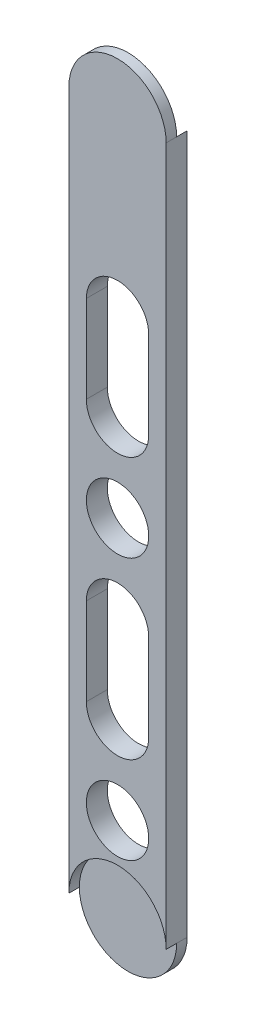
ISO-10303-21;
HEADER;
FILE_DESCRIPTION(('STEP AP214'),'2;1');
FILE_NAME('part.step','',(''),(''),'','','');
FILE_SCHEMA(('AUTOMOTIVE_DESIGN { 1 0 10303 214 1 1 1 1 }'));
ENDSEC;
DATA;
#1=APPLICATION_CONTEXT('core data for automotive mechanical design processes');
#2=APPLICATION_PROTOCOL_DEFINITION('international standard','automotive_design',2000,#1);
#3=PRODUCT_CONTEXT('',#1,'mechanical');
#4=PRODUCT('Part','Part','',(#3));
#5=PRODUCT_RELATED_PRODUCT_CATEGORY('part','',(#4));
#6=PRODUCT_DEFINITION_FORMATION('','',#4);
#7=PRODUCT_DEFINITION_CONTEXT('part definition',#1,'design');
#8=PRODUCT_DEFINITION('design','',#6,#7);
#9=PRODUCT_DEFINITION_SHAPE('','',#8);
#10=(LENGTH_UNIT() NAMED_UNIT(*) SI_UNIT(.MILLI.,.METRE.));
#11=(NAMED_UNIT(*) PLANE_ANGLE_UNIT() SI_UNIT($,.RADIAN.));
#12=(NAMED_UNIT(*) SI_UNIT($,.STERADIAN.) SOLID_ANGLE_UNIT());
#13=UNCERTAINTY_MEASURE_WITH_UNIT(LENGTH_MEASURE(1.E-05),#10,'distance_accuracy_value','');
#14=(GEOMETRIC_REPRESENTATION_CONTEXT(3) GLOBAL_UNCERTAINTY_ASSIGNED_CONTEXT((#13)) GLOBAL_UNIT_ASSIGNED_CONTEXT((#10,
#11,#12)) REPRESENTATION_CONTEXT('',''));
#15=CARTESIAN_POINT('',(0.,0.,0.));
#16=DIRECTION('',(0.,0.,1.));
#17=DIRECTION('',(1.,0.,0.));
#18=AXIS2_PLACEMENT_3D('',#15,#16,#17);
#19=CARTESIAN_POINT('',(0.,0.,6.));
#20=DIRECTION('',(0.,0.,1.));
#21=DIRECTION('',(1.,0.,0.));
#22=AXIS2_PLACEMENT_3D('',#19,#20,#21);
#23=PLANE('',#22);
#24=CARTESIAN_POINT('',(41.0421052631579,15.9190789473683,6.));
#25=DIRECTION('',(0.,0.,1.));
#26=DIRECTION('',(1.,0.,0.));
#27=AXIS2_PLACEMENT_3D('',#24,#25,#26);
#28=CIRCLE('',#27,8.925);
#29=CARTESIAN_POINT('',(49.9671052631579,15.9190789473683,6.));
#30=VERTEX_POINT('',#29);
#31=EDGE_CURVE('E260',#30,#30,#28,.T.);
#32=ORIENTED_EDGE('',*,*,#31,.F.);
#33=EDGE_LOOP('',(#32));
#34=FACE_BOUND('',#33,.T.);
#35=CARTESIAN_POINT('',(41.0421052631579,90.9190789473683,6.));
#36=DIRECTION('',(0.,0.,1.));
#37=DIRECTION('',(1.,0.,0.));
#38=AXIS2_PLACEMENT_3D('',#35,#36,#37);
#39=CIRCLE('',#38,8.925);
#40=CARTESIAN_POINT('',(49.9671052631579,90.9190789473683,6.));
#41=VERTEX_POINT('',#40);
#42=EDGE_CURVE('E160',#41,#41,#39,.T.);
#43=ORIENTED_EDGE('',*,*,#42,.F.);
#44=EDGE_LOOP('',(#43));
#45=FACE_BOUND('',#44,.T.);
#46=CARTESIAN_POINT('',(41.0421052631579,-9.08092105263172,6.));
#47=DIRECTION('',(0.,0.,1.));
#48=DIRECTION('',(1.,0.,0.));
#49=AXIS2_PLACEMENT_3D('',#46,#47,#48);
#50=CIRCLE('',#49,13.925);
#51=CARTESIAN_POINT('',(54.9671052631579,-9.08092105263172,6.));
#52=VERTEX_POINT('',#51);
#53=CARTESIAN_POINT('',(27.1171052631579,-9.08092105263173,6.));
#54=VERTEX_POINT('',#53);
#55=EDGE_CURVE('E196',#52,#54,#50,.T.);
#56=ORIENTED_EDGE('',*,*,#55,.F.);
#57=DIRECTION('',(0.,-1.,0.));
#58=VECTOR('',#57,1.);
#59=CARTESIAN_POINT('',(54.9671052631579,0.,6.));
#60=LINE('',#59,#58);
#61=CARTESIAN_POINT('',(54.9671052631579,190.919078947368,6.));
#62=VERTEX_POINT('',#61);
#63=EDGE_CURVE('E203',#62,#52,#60,.T.);
#64=ORIENTED_EDGE('',*,*,#63,.F.);
#65=CARTESIAN_POINT('',(41.0421052631579,190.919078947368,6.));
#66=DIRECTION('',(0.,0.,1.));
#67=DIRECTION('',(1.,0.,0.));
#68=AXIS2_PLACEMENT_3D('',#65,#66,#67);
#69=CIRCLE('',#68,13.925);
#70=CARTESIAN_POINT('',(27.1171052631579,190.919078947368,6.));
#71=VERTEX_POINT('',#70);
#72=EDGE_CURVE('E206',#71,#62,#69,.F.);
#73=ORIENTED_EDGE('',*,*,#72,.F.);
#74=DIRECTION('',(0.,-1.,0.));
#75=VECTOR('',#74,1.);
#76=CARTESIAN_POINT('',(27.1171052631579,0.,6.));
#77=LINE('',#76,#75);
#78=EDGE_CURVE('E210',#71,#54,#77,.T.);
#79=ORIENTED_EDGE('',*,*,#78,.T.);
#80=EDGE_LOOP('',(#56,#64,#73,#79));
#81=FACE_BOUND('',#80,.T.);
#82=DIRECTION('',(0.,-1.,0.));
#83=VECTOR('',#82,1.);
#84=CARTESIAN_POINT('',(32.1171052631578,0.,6.));
#85=LINE('',#84,#83);
#86=CARTESIAN_POINT('',(32.1171052631579,140.919078947368,6.));
#87=VERTEX_POINT('',#86);
#88=CARTESIAN_POINT('',(32.1171052631578,115.919078947368,6.));
#89=VERTEX_POINT('',#88);
#90=EDGE_CURVE('E169',#87,#89,#85,.T.);
#91=ORIENTED_EDGE('',*,*,#90,.F.);
#92=CARTESIAN_POINT('',(41.0421052631579,140.919078947368,6.));
#93=DIRECTION('',(0.,0.,1.));
#94=DIRECTION('',(1.,0.,0.));
#95=AXIS2_PLACEMENT_3D('',#92,#93,#94);
#96=CIRCLE('',#95,8.925);
#97=CARTESIAN_POINT('',(49.9671052631579,140.919078947368,6.));
#98=VERTEX_POINT('',#97);
#99=EDGE_CURVE('E166',#87,#98,#96,.F.);
#100=ORIENTED_EDGE('',*,*,#99,.T.);
#101=DIRECTION('',(0.,-1.,0.));
#102=VECTOR('',#101,1.);
#103=CARTESIAN_POINT('',(49.9671052631579,0.,6.));
#104=LINE('',#103,#102);
#105=CARTESIAN_POINT('',(49.9671052631579,115.919078947368,6.));
#106=VERTEX_POINT('',#105);
#107=EDGE_CURVE('E175',#98,#106,#104,.T.);
#108=ORIENTED_EDGE('',*,*,#107,.T.);
#109=CARTESIAN_POINT('',(41.0421052631579,115.919078947368,6.));
#110=DIRECTION('',(0.,0.,1.));
#111=DIRECTION('',(1.,0.,0.));
#112=AXIS2_PLACEMENT_3D('',#109,#110,#111);
#113=CIRCLE('',#112,8.92500000000001);
#114=EDGE_CURVE('E172',#106,#89,#113,.F.);
#115=ORIENTED_EDGE('',*,*,#114,.T.);
#116=EDGE_LOOP('',(#91,#100,#108,#115));
#117=FACE_BOUND('',#116,.T.);
#118=DIRECTION('',(0.,-1.,0.));
#119=VECTOR('',#118,1.);
#120=CARTESIAN_POINT('',(32.1171052631578,0.,6.));
#121=LINE('',#120,#119);
#122=CARTESIAN_POINT('',(32.1171052631578,65.9190789473683,6.));
#123=VERTEX_POINT('',#122);
#124=CARTESIAN_POINT('',(32.1171052631578,40.9190789473683,6.));
#125=VERTEX_POINT('',#124);
#126=EDGE_CURVE('E148',#123,#125,#121,.T.);
#127=ORIENTED_EDGE('',*,*,#126,.F.);
#128=CARTESIAN_POINT('',(41.0421052631579,65.9190789473683,6.));
#129=DIRECTION('',(0.,0.,1.));
#130=DIRECTION('',(1.,0.,0.));
#131=AXIS2_PLACEMENT_3D('',#128,#129,#130);
#132=CIRCLE('',#131,8.92500000000001);
#133=CARTESIAN_POINT('',(49.9671052631579,65.9190789473683,6.));
#134=VERTEX_POINT('',#133);
#135=EDGE_CURVE('E51',#123,#134,#132,.F.);
#136=ORIENTED_EDGE('',*,*,#135,.T.);
#137=DIRECTION('',(0.,-1.,0.));
#138=VECTOR('',#137,1.);
#139=CARTESIAN_POINT('',(49.9671052631578,0.,6.));
#140=LINE('',#139,#138);
#141=CARTESIAN_POINT('',(49.9671052631579,40.9190789473683,6.));
#142=VERTEX_POINT('',#141);
#143=EDGE_CURVE('E153',#134,#142,#140,.T.);
#144=ORIENTED_EDGE('',*,*,#143,.T.);
#145=CARTESIAN_POINT('',(41.0421052631579,40.9190789473683,6.));
#146=DIRECTION('',(0.,0.,1.));
#147=DIRECTION('',(1.,0.,0.));
#148=AXIS2_PLACEMENT_3D('',#145,#146,#147);
#149=CIRCLE('',#148,8.925);
#150=EDGE_CURVE('E139',#125,#142,#149,.T.);
#151=ORIENTED_EDGE('',*,*,#150,.F.);
#152=EDGE_LOOP('',(#127,#136,#144,#151));
#153=FACE_BOUND('',#152,.T.);
#154=ADVANCED_FACE('F35',(#34,#45,#81,#117,#153),#23,.T.);
#155=CARTESIAN_POINT('',(0.,0.,0.));
#156=DIRECTION('',(0.,0.,1.));
#157=DIRECTION('',(1.,0.,0.));
#158=AXIS2_PLACEMENT_3D('',#155,#156,#157);
#159=PLANE('',#158);
#160=CARTESIAN_POINT('',(41.0421052631579,15.9190789473683,0.));
#161=DIRECTION('',(0.,0.,1.));
#162=DIRECTION('',(1.,0.,0.));
#163=AXIS2_PLACEMENT_3D('',#160,#161,#162);
#164=CIRCLE('',#163,8.925);
#165=CARTESIAN_POINT('',(49.9671052631579,15.9190789473683,0.));
#166=VERTEX_POINT('',#165);
#167=EDGE_CURVE('E39',#166,#166,#164,.T.);
#168=ORIENTED_EDGE('',*,*,#167,.T.);
#169=EDGE_LOOP('',(#168));
#170=FACE_BOUND('',#169,.T.);
#171=CARTESIAN_POINT('',(41.0421052631579,140.919078947368,0.));
#172=DIRECTION('',(0.,0.,1.));
#173=DIRECTION('',(1.,0.,0.));
#174=AXIS2_PLACEMENT_3D('',#171,#172,#173);
#175=CIRCLE('',#174,8.925);
#176=CARTESIAN_POINT('',(32.1171052631579,140.919078947368,0.));
#177=VERTEX_POINT('',#176);
#178=CARTESIAN_POINT('',(49.9671052631579,140.919078947368,0.));
#179=VERTEX_POINT('',#178);
#180=EDGE_CURVE('E244',#177,#179,#175,.F.);
#181=ORIENTED_EDGE('',*,*,#180,.F.);
#182=DIRECTION('',(0.,-1.,0.));
#183=VECTOR('',#182,1.);
#184=CARTESIAN_POINT('',(32.1171052631578,0.,0.));
#185=LINE('',#184,#183);
#186=CARTESIAN_POINT('',(32.1171052631578,115.919078947368,0.));
#187=VERTEX_POINT('',#186);
#188=EDGE_CURVE('E236',#177,#187,#185,.T.);
#189=ORIENTED_EDGE('',*,*,#188,.T.);
#190=CARTESIAN_POINT('',(41.0421052631579,115.919078947368,0.));
#191=DIRECTION('',(0.,0.,1.));
#192=DIRECTION('',(1.,0.,0.));
#193=AXIS2_PLACEMENT_3D('',#190,#191,#192);
#194=CIRCLE('',#193,8.92500000000001);
#195=CARTESIAN_POINT('',(49.9671052631579,115.919078947368,0.));
#196=VERTEX_POINT('',#195);
#197=EDGE_CURVE('E239',#196,#187,#194,.F.);
#198=ORIENTED_EDGE('',*,*,#197,.F.);
#199=DIRECTION('',(0.,-1.,0.));
#200=VECTOR('',#199,1.);
#201=CARTESIAN_POINT('',(49.9671052631579,0.,0.));
#202=LINE('',#201,#200);
#203=EDGE_CURVE('E242',#179,#196,#202,.T.);
#204=ORIENTED_EDGE('',*,*,#203,.F.);
#205=EDGE_LOOP('',(#181,#189,#198,#204));
#206=FACE_BOUND('',#205,.T.);
#207=DIRECTION('',(0.,-1.,0.));
#208=VECTOR('',#207,1.);
#209=CARTESIAN_POINT('',(27.1171052631579,0.,0.));
#210=LINE('',#209,#208);
#211=CARTESIAN_POINT('',(27.1171052631578,190.919078947368,0.));
#212=VERTEX_POINT('',#211);
#213=CARTESIAN_POINT('',(27.1171052631579,-9.08092105263172,0.));
#214=VERTEX_POINT('',#213);
#215=EDGE_CURVE('E216',#212,#214,#210,.T.);
#216=ORIENTED_EDGE('',*,*,#215,.F.);
#217=CARTESIAN_POINT('',(41.0421052631579,190.919078947368,0.));
#218=DIRECTION('',(0.,0.,1.));
#219=DIRECTION('',(1.,0.,0.));
#220=AXIS2_PLACEMENT_3D('',#217,#218,#219);
#221=CIRCLE('',#220,13.925);
#222=CARTESIAN_POINT('',(54.9671052631579,190.919078947368,0.));
#223=VERTEX_POINT('',#222);
#224=EDGE_CURVE('E233',#212,#223,#221,.T.);
#225=ORIENTED_EDGE('',*,*,#224,.T.);
#226=DIRECTION('',(0.,-1.,0.));
#227=VECTOR('',#226,1.);
#228=CARTESIAN_POINT('',(54.9671052631579,0.,0.));
#229=LINE('',#228,#227);
#230=CARTESIAN_POINT('',(54.9671052631579,-9.08092105263172,0.));
#231=VERTEX_POINT('',#230);
#232=EDGE_CURVE('E200',#223,#231,#229,.T.);
#233=ORIENTED_EDGE('',*,*,#232,.T.);
#234=CARTESIAN_POINT('',(41.0421052631579,-9.08092105263172,0.));
#235=DIRECTION('',(0.,0.,1.));
#236=DIRECTION('',(1.,0.,0.));
#237=AXIS2_PLACEMENT_3D('',#234,#235,#236);
#238=CIRCLE('',#237,13.925);
#239=EDGE_CURVE('E207',#214,#231,#238,.T.);
#240=ORIENTED_EDGE('',*,*,#239,.F.);
#241=EDGE_LOOP('',(#216,#225,#233,#240));
#242=FACE_BOUND('',#241,.T.);
#243=CARTESIAN_POINT('',(41.0421052631579,90.9190789473683,0.));
#244=DIRECTION('',(0.,0.,1.));
#245=DIRECTION('',(1.,0.,0.));
#246=AXIS2_PLACEMENT_3D('',#243,#244,#245);
#247=CIRCLE('',#246,8.925);
#248=CARTESIAN_POINT('',(49.9671052631579,90.9190789473683,0.));
#249=VERTEX_POINT('',#248);
#250=EDGE_CURVE('E165',#249,#249,#247,.T.);
#251=ORIENTED_EDGE('',*,*,#250,.T.);
#252=EDGE_LOOP('',(#251));
#253=FACE_BOUND('',#252,.T.);
#254=CARTESIAN_POINT('',(41.0421052631579,65.9190789473683,0.));
#255=DIRECTION('',(0.,0.,1.));
#256=DIRECTION('',(1.,0.,0.));
#257=AXIS2_PLACEMENT_3D('',#254,#255,#256);
#258=CIRCLE('',#257,8.92500000000001);
#259=CARTESIAN_POINT('',(32.1171052631578,65.9190789473683,0.));
#260=VERTEX_POINT('',#259);
#261=CARTESIAN_POINT('',(49.9671052631579,65.9190789473683,0.));
#262=VERTEX_POINT('',#261);
#263=EDGE_CURVE('E11',#260,#262,#258,.F.);
#264=ORIENTED_EDGE('',*,*,#263,.F.);
#265=DIRECTION('',(0.,-1.,0.));
#266=VECTOR('',#265,1.);
#267=CARTESIAN_POINT('',(32.1171052631578,0.,0.));
#268=LINE('',#267,#266);
#269=CARTESIAN_POINT('',(32.1171052631578,40.9190789473683,0.));
#270=VERTEX_POINT('',#269);
#271=EDGE_CURVE('E246',#260,#270,#268,.T.);
#272=ORIENTED_EDGE('',*,*,#271,.T.);
#273=CARTESIAN_POINT('',(41.0421052631579,40.9190789473683,0.));
#274=DIRECTION('',(0.,0.,1.));
#275=DIRECTION('',(1.,0.,0.));
#276=AXIS2_PLACEMENT_3D('',#273,#274,#275);
#277=CIRCLE('',#276,8.925);
#278=CARTESIAN_POINT('',(49.9671052631579,40.9190789473683,0.));
#279=VERTEX_POINT('',#278);
#280=EDGE_CURVE('E142',#270,#279,#277,.T.);
#281=ORIENTED_EDGE('',*,*,#280,.T.);
#282=DIRECTION('',(0.,-1.,0.));
#283=VECTOR('',#282,1.);
#284=CARTESIAN_POINT('',(49.9671052631578,0.,0.));
#285=LINE('',#284,#283);
#286=EDGE_CURVE('E44',#262,#279,#285,.T.);
#287=ORIENTED_EDGE('',*,*,#286,.F.);
#288=EDGE_LOOP('',(#264,#272,#281,#287));
#289=FACE_BOUND('',#288,.T.);
#290=ADVANCED_FACE('F257',(#170,#206,#242,#253,#289),#159,.F.);
#291=CARTESIAN_POINT('',(41.0421052631579,190.919078947368,6.));
#292=DIRECTION('',(0.,0.,-1.));
#293=DIRECTION('',(-1.,0.,0.));
#294=AXIS2_PLACEMENT_3D('',#291,#292,#293);
#295=CYLINDRICAL_SURFACE('',#294,13.925);
#296=DIRECTION('',(0.,0.,-1.));
#297=VECTOR('',#296,1.);
#298=CARTESIAN_POINT('',(54.9671052631579,190.919078947368,6.));
#299=LINE('',#298,#297);
#300=CARTESIAN_POINT('',(54.9671052631579,190.919078947368,3.));
#301=VERTEX_POINT('',#300);
#302=EDGE_CURVE('E230',#62,#301,#299,.T.);
#303=ORIENTED_EDGE('',*,*,#302,.T.);
#304=CARTESIAN_POINT('',(41.0421052631579,190.919078947368,3.));
#305=DIRECTION('',(0.,0.,-1.));
#306=DIRECTION('',(-1.,0.,0.));
#307=AXIS2_PLACEMENT_3D('',#304,#305,#306);
#308=CIRCLE('',#307,13.925);
#309=CARTESIAN_POINT('',(27.1171052631579,190.919078947368,3.));
#310=VERTEX_POINT('',#309);
#311=EDGE_CURVE('E188',#310,#301,#308,.T.);
#312=ORIENTED_EDGE('',*,*,#311,.F.);
#313=DIRECTION('',(0.,0.,-1.));
#314=VECTOR('',#313,1.);
#315=CARTESIAN_POINT('',(27.1171052631579,190.919078947368,6.));
#316=LINE('',#315,#314);
#317=EDGE_CURVE('E227',#71,#310,#316,.T.);
#318=ORIENTED_EDGE('',*,*,#317,.F.);
#319=ORIENTED_EDGE('',*,*,#72,.T.);
#320=EDGE_LOOP('',(#303,#312,#318,#319));
#321=FACE_BOUND('',#320,.T.);
#322=ADVANCED_FACE('F327',(#321),#295,.T.);
#323=CARTESIAN_POINT('',(41.0421052631579,-9.08092105263172,6.));
#324=DIRECTION('',(0.,0.,-1.));
#325=DIRECTION('',(-1.,0.,0.));
#326=AXIS2_PLACEMENT_3D('',#323,#324,#325);
#327=CYLINDRICAL_SURFACE('',#326,13.925);
#328=CARTESIAN_POINT('',(41.0421052631579,-9.08092105263172,3.));
#329=DIRECTION('',(0.,0.,1.));
#330=DIRECTION('',(1.,0.,0.));
#331=AXIS2_PLACEMENT_3D('',#328,#329,#330);
#332=CIRCLE('',#331,13.925);
#333=CARTESIAN_POINT('',(27.1171052631579,-9.08092105263172,3.));
#334=VERTEX_POINT('',#333);
#335=CARTESIAN_POINT('',(54.9671052631579,-9.08092105263172,3.));
#336=VERTEX_POINT('',#335);
#337=EDGE_CURVE('E201',#334,#336,#332,.T.);
#338=ORIENTED_EDGE('',*,*,#337,.F.);
#339=DIRECTION('',(0.,0.,-1.));
#340=VECTOR('',#339,1.);
#341=CARTESIAN_POINT('',(27.1171052631579,-9.08092105263172,6.));
#342=LINE('',#341,#340);
#343=EDGE_CURVE('E224',#334,#214,#342,.T.);
#344=ORIENTED_EDGE('',*,*,#343,.T.);
#345=ORIENTED_EDGE('',*,*,#239,.T.);
#346=DIRECTION('',(0.,0.,-1.));
#347=VECTOR('',#346,1.);
#348=CARTESIAN_POINT('',(54.9671052631579,-9.08092105263172,6.));
#349=LINE('',#348,#347);
#350=EDGE_CURVE('E213',#336,#231,#349,.T.);
#351=ORIENTED_EDGE('',*,*,#350,.F.);
#352=EDGE_LOOP('',(#338,#344,#345,#351));
#353=FACE_BOUND('',#352,.T.);
#354=ADVANCED_FACE('F329',(#353),#327,.T.);
#355=CARTESIAN_POINT('',(54.9671052631579,0.,6.));
#356=DIRECTION('',(1.,0.,0.));
#357=DIRECTION('',(0.,1.,0.));
#358=AXIS2_PLACEMENT_3D('',#355,#356,#357);
#359=PLANE('',#358);
#360=ORIENTED_EDGE('',*,*,#232,.F.);
#361=DIRECTION('',(0.,0.,-1.));
#362=VECTOR('',#361,1.);
#363=CARTESIAN_POINT('',(54.9671052631579,190.919078947368,3.));
#364=LINE('',#363,#362);
#365=EDGE_CURVE('E194',#301,#223,#364,.T.);
#366=ORIENTED_EDGE('',*,*,#365,.F.);
#367=ORIENTED_EDGE('',*,*,#302,.F.);
#368=ORIENTED_EDGE('',*,*,#63,.T.);
#369=EDGE_CURVE('E221',#52,#336,#349,.T.);
#370=ORIENTED_EDGE('',*,*,#369,.T.);
#371=ORIENTED_EDGE('',*,*,#350,.T.);
#372=EDGE_LOOP('',(#360,#366,#367,#368,#370,#371));
#373=FACE_BOUND('',#372,.T.);
#374=ADVANCED_FACE('F37',(#373),#359,.T.);
#375=CARTESIAN_POINT('',(27.1171052631579,0.,6.));
#376=DIRECTION('',(1.,0.,0.));
#377=DIRECTION('',(0.,1.,0.));
#378=AXIS2_PLACEMENT_3D('',#375,#376,#377);
#379=PLANE('',#378);
#380=ORIENTED_EDGE('',*,*,#215,.T.);
#381=ORIENTED_EDGE('',*,*,#343,.F.);
#382=EDGE_CURVE('E225',#54,#334,#342,.T.);
#383=ORIENTED_EDGE('',*,*,#382,.F.);
#384=ORIENTED_EDGE('',*,*,#78,.F.);
#385=ORIENTED_EDGE('',*,*,#317,.T.);
#386=DIRECTION('',(0.,0.,-1.));
#387=VECTOR('',#386,1.);
#388=CARTESIAN_POINT('',(27.1171052631579,190.919078947368,3.));
#389=LINE('',#388,#387);
#390=EDGE_CURVE('E191',#310,#212,#389,.T.);
#391=ORIENTED_EDGE('',*,*,#390,.T.);
#392=EDGE_LOOP('',(#380,#381,#383,#384,#385,#391));
#393=FACE_BOUND('',#392,.T.);
#394=ADVANCED_FACE('F322',(#393),#379,.F.);
#395=CARTESIAN_POINT('',(41.0421052631579,-9.08092105263172,3.));
#396=DIRECTION('',(0.,0.,1.));
#397=DIRECTION('',(1.,0.,0.));
#398=AXIS2_PLACEMENT_3D('',#395,#396,#397);
#399=CYLINDRICAL_SURFACE('',#398,13.925);
#400=ORIENTED_EDGE('',*,*,#369,.F.);
#401=ORIENTED_EDGE('',*,*,#55,.T.);
#402=ORIENTED_EDGE('',*,*,#382,.T.);
#403=EDGE_CURVE('E197',#336,#334,#332,.T.);
#404=ORIENTED_EDGE('',*,*,#403,.F.);
#405=EDGE_LOOP('',(#400,#401,#402,#404));
#406=FACE_BOUND('',#405,.T.);
#407=ADVANCED_FACE('F319',(#406),#399,.F.);
#408=CARTESIAN_POINT('',(41.0421052631579,-9.08092105263172,3.));
#409=DIRECTION('',(0.,0.,1.));
#410=DIRECTION('',(1.,0.,0.));
#411=AXIS2_PLACEMENT_3D('',#408,#409,#410);
#412=PLANE('',#411);
#413=ORIENTED_EDGE('',*,*,#403,.T.);
#414=ORIENTED_EDGE('',*,*,#337,.T.);
#415=EDGE_LOOP('',(#413,#414));
#416=FACE_BOUND('',#415,.T.);
#417=ADVANCED_FACE('F315',(#416),#412,.T.);
#418=CARTESIAN_POINT('',(41.0421052631579,190.919078947368,3.));
#419=DIRECTION('',(0.,0.,-1.));
#420=DIRECTION('',(-1.,0.,0.));
#421=AXIS2_PLACEMENT_3D('',#418,#419,#420);
#422=CYLINDRICAL_SURFACE('',#421,13.925);
#423=ORIENTED_EDGE('',*,*,#365,.T.);
#424=ORIENTED_EDGE('',*,*,#224,.F.);
#425=ORIENTED_EDGE('',*,*,#390,.F.);
#426=EDGE_CURVE('E181',#301,#310,#308,.T.);
#427=ORIENTED_EDGE('',*,*,#426,.F.);
#428=EDGE_LOOP('',(#423,#424,#425,#427));
#429=FACE_BOUND('',#428,.T.);
#430=ADVANCED_FACE('F311',(#429),#422,.F.);
#431=CARTESIAN_POINT('',(41.0421052631579,190.919078947368,3.));
#432=DIRECTION('',(0.,0.,-1.));
#433=DIRECTION('',(-1.,0.,0.));
#434=AXIS2_PLACEMENT_3D('',#431,#432,#433);
#435=PLANE('',#434);
#436=ORIENTED_EDGE('',*,*,#311,.T.);
#437=ORIENTED_EDGE('',*,*,#426,.T.);
#438=EDGE_LOOP('',(#436,#437));
#439=FACE_BOUND('',#438,.T.);
#440=ADVANCED_FACE('F308',(#439),#435,.T.);
#441=CARTESIAN_POINT('',(41.0421052631579,140.919078947368,-4.));
#442=DIRECTION('',(0.,0.,1.));
#443=DIRECTION('',(1.,0.,0.));
#444=AXIS2_PLACEMENT_3D('',#441,#442,#443);
#445=CYLINDRICAL_SURFACE('',#444,8.925);
#446=ORIENTED_EDGE('',*,*,#180,.T.);
#447=DIRECTION('',(0.,0.,1.));
#448=VECTOR('',#447,1.);
#449=CARTESIAN_POINT('',(49.9671052631579,140.919078947368,-4.));
#450=LINE('',#449,#448);
#451=EDGE_CURVE('E179',#179,#98,#450,.T.);
#452=ORIENTED_EDGE('',*,*,#451,.T.);
#453=ORIENTED_EDGE('',*,*,#99,.F.);
#454=DIRECTION('',(0.,0.,1.));
#455=VECTOR('',#454,1.);
#456=CARTESIAN_POINT('',(32.1171052631579,140.919078947368,-4.));
#457=LINE('',#456,#455);
#458=EDGE_CURVE('E178',#177,#87,#457,.T.);
#459=ORIENTED_EDGE('',*,*,#458,.F.);
#460=EDGE_LOOP('',(#446,#452,#453,#459));
#461=FACE_BOUND('',#460,.T.);
#462=ADVANCED_FACE('F283',(#461),#445,.F.);
#463=CARTESIAN_POINT('',(49.9671052631579,0.,-4.));
#464=DIRECTION('',(-1.,0.,0.));
#465=DIRECTION('',(0.,0.,1.));
#466=AXIS2_PLACEMENT_3D('',#463,#464,#465);
#467=PLANE('',#466);
#468=ORIENTED_EDGE('',*,*,#203,.T.);
#469=DIRECTION('',(0.,0.,1.));
#470=VECTOR('',#469,1.);
#471=CARTESIAN_POINT('',(49.9671052631579,115.919078947368,-4.));
#472=LINE('',#471,#470);
#473=EDGE_CURVE('E182',#196,#106,#472,.T.);
#474=ORIENTED_EDGE('',*,*,#473,.T.);
#475=ORIENTED_EDGE('',*,*,#107,.F.);
#476=ORIENTED_EDGE('',*,*,#451,.F.);
#477=EDGE_LOOP('',(#468,#474,#475,#476));
#478=FACE_BOUND('',#477,.T.);
#479=ADVANCED_FACE('F291',(#478),#467,.T.);
#480=CARTESIAN_POINT('',(41.0421052631579,115.919078947368,-4.));
#481=DIRECTION('',(0.,0.,1.));
#482=DIRECTION('',(1.,0.,0.));
#483=AXIS2_PLACEMENT_3D('',#480,#481,#482);
#484=CYLINDRICAL_SURFACE('',#483,8.92500000000001);
#485=ORIENTED_EDGE('',*,*,#197,.T.);
#486=DIRECTION('',(0.,0.,1.));
#487=VECTOR('',#486,1.);
#488=CARTESIAN_POINT('',(32.1171052631578,115.919078947368,-4.));
#489=LINE('',#488,#487);
#490=EDGE_CURVE('E184',#187,#89,#489,.T.);
#491=ORIENTED_EDGE('',*,*,#490,.T.);
#492=ORIENTED_EDGE('',*,*,#114,.F.);
#493=ORIENTED_EDGE('',*,*,#473,.F.);
#494=EDGE_LOOP('',(#485,#491,#492,#493));
#495=FACE_BOUND('',#494,.T.);
#496=ADVANCED_FACE('F294',(#495),#484,.F.);
#497=CARTESIAN_POINT('',(32.1171052631578,0.,-4.));
#498=DIRECTION('',(-1.,0.,0.));
#499=DIRECTION('',(0.,-1.,0.));
#500=AXIS2_PLACEMENT_3D('',#497,#498,#499);
#501=PLANE('',#500);
#502=ORIENTED_EDGE('',*,*,#458,.T.);
#503=ORIENTED_EDGE('',*,*,#90,.T.);
#504=ORIENTED_EDGE('',*,*,#490,.F.);
#505=ORIENTED_EDGE('',*,*,#188,.F.);
#506=EDGE_LOOP('',(#502,#503,#504,#505));
#507=FACE_BOUND('',#506,.T.);
#508=ADVANCED_FACE('F279',(#507),#501,.F.);
#509=CARTESIAN_POINT('',(41.0421052631579,90.9190789473683,-4.));
#510=DIRECTION('',(0.,0.,1.));
#511=DIRECTION('',(1.,0.,0.));
#512=AXIS2_PLACEMENT_3D('',#509,#510,#511);
#513=CYLINDRICAL_SURFACE('',#512,8.925);
#514=ORIENTED_EDGE('',*,*,#42,.T.);
#515=EDGE_LOOP('',(#514));
#516=FACE_BOUND('',#515,.T.);
#517=ORIENTED_EDGE('',*,*,#250,.F.);
#518=EDGE_LOOP('',(#517));
#519=FACE_BOUND('',#518,.T.);
#520=ADVANCED_FACE('F301',(#516,#519),#513,.F.);
#521=CARTESIAN_POINT('',(41.0421052631579,65.9190789473683,-4.));
#522=DIRECTION('',(0.,0.,1.));
#523=DIRECTION('',(1.,0.,0.));
#524=AXIS2_PLACEMENT_3D('',#521,#522,#523);
#525=CYLINDRICAL_SURFACE('',#524,8.92500000000001);
#526=ORIENTED_EDGE('',*,*,#263,.T.);
#527=DIRECTION('',(0.,0.,1.));
#528=VECTOR('',#527,1.);
#529=CARTESIAN_POINT('',(49.9671052631579,65.9190789473683,-4.));
#530=LINE('',#529,#528);
#531=EDGE_CURVE('E158',#262,#134,#530,.T.);
#532=ORIENTED_EDGE('',*,*,#531,.T.);
#533=ORIENTED_EDGE('',*,*,#135,.F.);
#534=DIRECTION('',(0.,0.,1.));
#535=VECTOR('',#534,1.);
#536=CARTESIAN_POINT('',(32.1171052631578,65.9190789473683,-4.));
#537=LINE('',#536,#535);
#538=EDGE_CURVE('E145',#260,#123,#537,.T.);
#539=ORIENTED_EDGE('',*,*,#538,.F.);
#540=EDGE_LOOP('',(#526,#532,#533,#539));
#541=FACE_BOUND('',#540,.T.);
#542=ADVANCED_FACE('F258',(#541),#525,.F.);
#543=CARTESIAN_POINT('',(49.9671052631578,0.,-4.));
#544=DIRECTION('',(-1.,0.,0.));
#545=DIRECTION('',(0.,-1.,0.));
#546=AXIS2_PLACEMENT_3D('',#543,#544,#545);
#547=PLANE('',#546);
#548=ORIENTED_EDGE('',*,*,#286,.T.);
#549=DIRECTION('',(0.,0.,1.));
#550=VECTOR('',#549,1.);
#551=CARTESIAN_POINT('',(49.9671052631579,40.9190789473683,-4.));
#552=LINE('',#551,#550);
#553=EDGE_CURVE('E144',#279,#142,#552,.T.);
#554=ORIENTED_EDGE('',*,*,#553,.T.);
#555=ORIENTED_EDGE('',*,*,#143,.F.);
#556=ORIENTED_EDGE('',*,*,#531,.F.);
#557=EDGE_LOOP('',(#548,#554,#555,#556));
#558=FACE_BOUND('',#557,.T.);
#559=ADVANCED_FACE('F254',(#558),#547,.T.);
#560=CARTESIAN_POINT('',(41.0421052631579,40.9190789473683,-4.));
#561=DIRECTION('',(0.,0.,1.));
#562=DIRECTION('',(1.,0.,0.));
#563=AXIS2_PLACEMENT_3D('',#560,#561,#562);
#564=CYLINDRICAL_SURFACE('',#563,8.925);
#565=DIRECTION('',(0.,0.,1.));
#566=VECTOR('',#565,1.);
#567=CARTESIAN_POINT('',(32.1171052631578,40.9190789473683,-4.));
#568=LINE('',#567,#566);
#569=EDGE_CURVE('E59',#270,#125,#568,.T.);
#570=ORIENTED_EDGE('',*,*,#569,.T.);
#571=ORIENTED_EDGE('',*,*,#150,.T.);
#572=ORIENTED_EDGE('',*,*,#553,.F.);
#573=ORIENTED_EDGE('',*,*,#280,.F.);
#574=EDGE_LOOP('',(#570,#571,#572,#573));
#575=FACE_BOUND('',#574,.T.);
#576=ADVANCED_FACE('F136',(#575),#564,.F.);
#577=CARTESIAN_POINT('',(32.1171052631578,0.,-4.));
#578=DIRECTION('',(-1.,0.,0.));
#579=DIRECTION('',(0.,0.,1.));
#580=AXIS2_PLACEMENT_3D('',#577,#578,#579);
#581=PLANE('',#580);
#582=ORIENTED_EDGE('',*,*,#538,.T.);
#583=ORIENTED_EDGE('',*,*,#126,.T.);
#584=ORIENTED_EDGE('',*,*,#569,.F.);
#585=ORIENTED_EDGE('',*,*,#271,.F.);
#586=EDGE_LOOP('',(#582,#583,#584,#585));
#587=FACE_BOUND('',#586,.T.);
#588=ADVANCED_FACE('F149',(#587),#581,.F.);
#589=CARTESIAN_POINT('',(41.0421052631579,15.9190789473683,-4.));
#590=DIRECTION('',(0.,0.,1.));
#591=DIRECTION('',(1.,0.,0.));
#592=AXIS2_PLACEMENT_3D('',#589,#590,#591);
#593=CYLINDRICAL_SURFACE('',#592,8.925);
#594=ORIENTED_EDGE('',*,*,#31,.T.);
#595=EDGE_LOOP('',(#594));
#596=FACE_BOUND('',#595,.T.);
#597=ORIENTED_EDGE('',*,*,#167,.F.);
#598=EDGE_LOOP('',(#597));
#599=FACE_BOUND('',#598,.T.);
#600=ADVANCED_FACE('F265',(#596,#599),#593,.F.);
#601=CLOSED_SHELL('',(#154,#290,#322,#354,#374,#394,#407,#417,#430,#440,#462,#479,#496,#508,
#520,#542,#559,#576,#588,#600));
#602=MANIFOLD_SOLID_BREP('B2',#601);
#603=ADVANCED_BREP_SHAPE_REPRESENTATION('',(#18,#602),#14);
#604=SHAPE_DEFINITION_REPRESENTATION(#9,#603);
ENDSEC;
END-ISO-10303-21;
